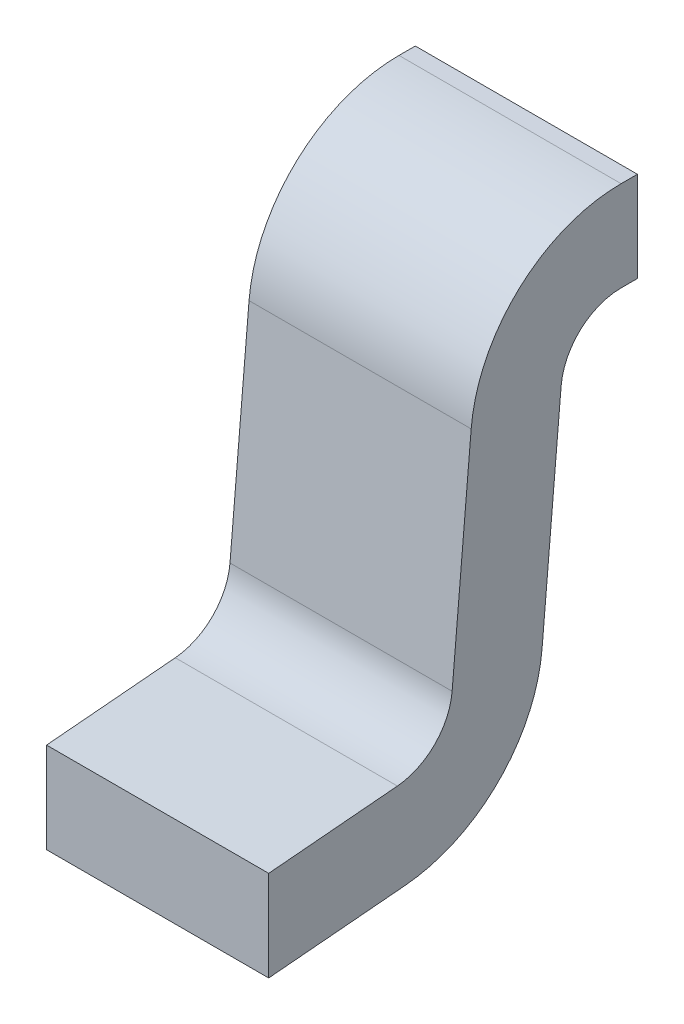
ISO-10303-21;
HEADER;
FILE_DESCRIPTION(('STEP AP214'),'2;1');
FILE_NAME('part.step','',(''),(''),'','','');
FILE_SCHEMA(('AUTOMOTIVE_DESIGN { 1 0 10303 214 1 1 1 1 }'));
ENDSEC;
DATA;
#1=APPLICATION_CONTEXT('core data for automotive mechanical design processes');
#2=APPLICATION_PROTOCOL_DEFINITION('international standard','automotive_design',2000,#1);
#3=PRODUCT_CONTEXT('',#1,'mechanical');
#4=PRODUCT('Part','Part','',(#3));
#5=PRODUCT_RELATED_PRODUCT_CATEGORY('part','',(#4));
#6=PRODUCT_DEFINITION_FORMATION('','',#4);
#7=PRODUCT_DEFINITION_CONTEXT('part definition',#1,'design');
#8=PRODUCT_DEFINITION('design','',#6,#7);
#9=PRODUCT_DEFINITION_SHAPE('','',#8);
#10=(LENGTH_UNIT() NAMED_UNIT(*) SI_UNIT(.MILLI.,.METRE.));
#11=(NAMED_UNIT(*) PLANE_ANGLE_UNIT() SI_UNIT($,.RADIAN.));
#12=(NAMED_UNIT(*) SI_UNIT($,.STERADIAN.) SOLID_ANGLE_UNIT());
#13=UNCERTAINTY_MEASURE_WITH_UNIT(LENGTH_MEASURE(1.E-05),#10,'distance_accuracy_value','');
#14=(GEOMETRIC_REPRESENTATION_CONTEXT(3) GLOBAL_UNCERTAINTY_ASSIGNED_CONTEXT((#13)) GLOBAL_UNIT_ASSIGNED_CONTEXT((#10,
#11,#12)) REPRESENTATION_CONTEXT('',''));
#15=CARTESIAN_POINT('',(0.,0.,0.));
#16=DIRECTION('',(0.,0.,1.));
#17=DIRECTION('',(1.,0.,0.));
#18=AXIS2_PLACEMENT_3D('',#15,#16,#17);
#19=CARTESIAN_POINT('',(-0.187452,0.,0.));
#20=DIRECTION('',(1.,0.,0.));
#21=DIRECTION('',(0.,1.,0.));
#22=AXIS2_PLACEMENT_3D('',#19,#20,#21);
#23=PLANE('',#22);
#24=DIRECTION('',(0.,-0.0871557427476379,0.996194698091747));
#25=VECTOR('',#24,1.);
#26=CARTESIAN_POINT('',(-0.187452,-0.03121454129347,0.23999111031));
#27=LINE('',#26,#25);
#28=CARTESIAN_POINT('',(-0.187452,-0.03121454129347,0.23999111031));
#29=VERTEX_POINT('',#28);
#30=CARTESIAN_POINT('',(-0.187452,-0.0502178567584,0.4572));
#31=VERTEX_POINT('',#30);
#32=EDGE_CURVE('E41',#29,#31,#27,.T.);
#33=ORIENTED_EDGE('',*,*,#32,.F.);
#34=CARTESIAN_POINT('',(-0.187452,0.06999884003265,0.248846133773));
#35=DIRECTION('',(1.,0.,0.));
#36=DIRECTION('',(0.,-0.996194698091747,-0.0871557427476379));
#37=AXIS2_PLACEMENT_3D('',#34,#35,#36);
#38=CIRCLE('',#37,0.1016);
#39=CARTESIAN_POINT('',(-0.187452,0.0611438165695,0.147632752447));
#40=VERTEX_POINT('',#39);
#41=EDGE_CURVE('E11',#29,#40,#38,.T.);
#42=ORIENTED_EDGE('',*,*,#41,.T.);
#43=DIRECTION('',(0.,0.996194698091747,-0.0871557427476379));
#44=VECTOR('',#43,1.);
#45=CARTESIAN_POINT('',(-0.187452,0.0611438165695,0.147632752447));
#46=LINE('',#45,#44);
#47=CARTESIAN_POINT('',(-0.187452,0.428537558658,0.115489964964));
#48=VERTEX_POINT('',#47);
#49=EDGE_CURVE('E28',#40,#48,#46,.T.);
#50=ORIENTED_EDGE('',*,*,#49,.T.);
#51=CARTESIAN_POINT('',(-0.187452,0.4064,-0.137543488351));
#52=DIRECTION('',(-1.,0.,0.));
#53=DIRECTION('',(0.,0.0871557427476379,0.996194698091747));
#54=AXIS2_PLACEMENT_3D('',#51,#52,#53);
#55=CIRCLE('',#54,0.254);
#56=CARTESIAN_POINT('',(-0.187452,0.6604,-0.137543488351));
#57=VERTEX_POINT('',#56);
#58=EDGE_CURVE('E230',#48,#57,#55,.T.);
#59=ORIENTED_EDGE('',*,*,#58,.T.);
#60=DIRECTION('',(0.,0.,1.));
#61=VECTOR('',#60,1.);
#62=CARTESIAN_POINT('',(-0.187452,0.6604,-0.1651));
#63=LINE('',#62,#61);
#64=CARTESIAN_POINT('',(-0.187452,0.6604,-0.1651));
#65=VERTEX_POINT('',#64);
#66=EDGE_CURVE('E180',#65,#57,#63,.T.);
#67=ORIENTED_EDGE('',*,*,#66,.F.);
#68=DIRECTION('',(0.,1.,0.));
#69=VECTOR('',#68,1.);
#70=CARTESIAN_POINT('',(-0.187452,0.508,-0.1651));
#71=LINE('',#70,#69);
#72=CARTESIAN_POINT('',(-0.187452,0.508,-0.1651));
#73=VERTEX_POINT('',#72);
#74=EDGE_CURVE('E181',#73,#65,#71,.T.);
#75=ORIENTED_EDGE('',*,*,#74,.F.);
#76=DIRECTION('',(0.,0.,-1.));
#77=VECTOR('',#76,1.);
#78=CARTESIAN_POINT('',(-0.187452,0.508,-0.137543488351));
#79=LINE('',#78,#77);
#80=CARTESIAN_POINT('',(-0.187452,0.508,-0.137543488351));
#81=VERTEX_POINT('',#80);
#82=EDGE_CURVE('E186',#81,#73,#79,.T.);
#83=ORIENTED_EDGE('',*,*,#82,.F.);
#84=CARTESIAN_POINT('',(-0.187452,0.4064,-0.137543488351));
#85=DIRECTION('',(1.,0.,0.));
#86=DIRECTION('',(0.,1.,0.));
#87=AXIS2_PLACEMENT_3D('',#84,#85,#86);
#88=CIRCLE('',#87,0.1016);
#89=CARTESIAN_POINT('',(-0.187452,0.415255023463,-0.03633010702521));
#90=VERTEX_POINT('',#89);
#91=EDGE_CURVE('E234',#81,#90,#88,.T.);
#92=ORIENTED_EDGE('',*,*,#91,.T.);
#93=DIRECTION('',(0.,-0.996194698091747,0.0871557427476379));
#94=VECTOR('',#93,1.);
#95=CARTESIAN_POINT('',(-0.187452,0.415255023463,-0.03633010702521));
#96=LINE('',#95,#94);
#97=CARTESIAN_POINT('',(-0.187452,0.04786128137476,-0.004187319542116));
#98=VERTEX_POINT('',#97);
#99=EDGE_CURVE('E174',#90,#98,#96,.T.);
#100=ORIENTED_EDGE('',*,*,#99,.T.);
#101=CARTESIAN_POINT('',(-0.187452,0.06999884003265,0.248846133773));
#102=DIRECTION('',(-1.,0.,0.));
#103=DIRECTION('',(0.,-0.0871557427476379,-0.996194698091747));
#104=AXIS2_PLACEMENT_3D('',#101,#102,#103);
#105=CIRCLE('',#104,0.254);
#106=CARTESIAN_POINT('',(-0.187452,-0.183034613283,0.226708575115));
#107=VERTEX_POINT('',#106);
#108=EDGE_CURVE('E137',#98,#107,#105,.T.);
#109=ORIENTED_EDGE('',*,*,#108,.T.);
#110=DIRECTION('',(0.,0.0871557427476379,-0.996194698091747));
#111=VECTOR('',#110,1.);
#112=CARTESIAN_POINT('',(-0.187452,-0.2032,0.4572));
#113=LINE('',#112,#111);
#114=CARTESIAN_POINT('',(-0.187452,-0.2032,0.4572));
#115=VERTEX_POINT('',#114);
#116=EDGE_CURVE('E141',#115,#107,#113,.T.);
#117=ORIENTED_EDGE('',*,*,#116,.F.);
#118=DIRECTION('',(0.,1.,0.));
#119=VECTOR('',#118,1.);
#120=CARTESIAN_POINT('',(-0.187452,-0.2032,0.4572));
#121=LINE('',#120,#119);
#122=EDGE_CURVE('E175',#115,#31,#121,.T.);
#123=ORIENTED_EDGE('',*,*,#122,.T.);
#124=EDGE_LOOP('',(#33,#42,#50,#59,#67,#75,#83,#92,#100,#109,#117,#123));
#125=FACE_BOUND('',#124,.T.);
#126=ADVANCED_FACE('F17',(#125),#23,.F.);
#127=CARTESIAN_POINT('',(0.2249424,-0.2032,0.4572));
#128=DIRECTION('',(0.,0.,-1.));
#129=DIRECTION('',(0.,-1.,0.));
#130=AXIS2_PLACEMENT_3D('',#127,#128,#129);
#131=PLANE('',#130);
#132=DIRECTION('',(1.,0.,0.));
#133=VECTOR('',#132,1.);
#134=CARTESIAN_POINT('',(-0.187452,-0.2032,0.4572));
#135=LINE('',#134,#133);
#136=CARTESIAN_POINT('',(0.187452,-0.2032,0.4572));
#137=VERTEX_POINT('',#136);
#138=EDGE_CURVE('E196',#115,#137,#135,.T.);
#139=ORIENTED_EDGE('',*,*,#138,.T.);
#140=DIRECTION('',(0.,1.,0.));
#141=VECTOR('',#140,1.);
#142=CARTESIAN_POINT('',(0.187452,-0.2032,0.4572));
#143=LINE('',#142,#141);
#144=CARTESIAN_POINT('',(0.187452,-0.0502178567584,0.4572));
#145=VERTEX_POINT('',#144);
#146=EDGE_CURVE('E216',#137,#145,#143,.T.);
#147=ORIENTED_EDGE('',*,*,#146,.T.);
#148=DIRECTION('',(1.,0.,0.));
#149=VECTOR('',#148,1.);
#150=CARTESIAN_POINT('',(-0.187452,-0.0502178567584,0.4572));
#151=LINE('',#150,#149);
#152=EDGE_CURVE('E170',#31,#145,#151,.T.);
#153=ORIENTED_EDGE('',*,*,#152,.F.);
#154=ORIENTED_EDGE('',*,*,#122,.F.);
#155=EDGE_LOOP('',(#139,#147,#153,#154));
#156=FACE_BOUND('',#155,.T.);
#157=ADVANCED_FACE('F274',(#156),#131,.F.);
#158=CARTESIAN_POINT('',(-0.187452,-0.02378429437146,0.155062999369));
#159=DIRECTION('',(0.,0.996194698091747,0.0871557427476379));
#160=DIRECTION('',(1.,0.,0.));
#161=AXIS2_PLACEMENT_3D('',#158,#159,#160);
#162=PLANE('',#161);
#163=DIRECTION('',(0.,-0.0871557427476379,0.996194698091747));
#164=VECTOR('',#163,1.);
#165=CARTESIAN_POINT('',(0.187452,-0.03121454129347,0.23999111031));
#166=LINE('',#165,#164);
#167=CARTESIAN_POINT('',(0.187452,-0.03121454129347,0.23999111031));
#168=VERTEX_POINT('',#167);
#169=EDGE_CURVE('E157',#168,#145,#166,.T.);
#170=ORIENTED_EDGE('',*,*,#169,.F.);
#171=DIRECTION('',(1.,0.,0.));
#172=VECTOR('',#171,1.);
#173=CARTESIAN_POINT('',(-0.187452,-0.03121454129347,0.23999111031));
#174=LINE('',#173,#172);
#175=EDGE_CURVE('E171',#29,#168,#174,.T.);
#176=ORIENTED_EDGE('',*,*,#175,.F.);
#177=ORIENTED_EDGE('',*,*,#32,.T.);
#178=ORIENTED_EDGE('',*,*,#152,.T.);
#179=EDGE_LOOP('',(#170,#176,#177,#178));
#180=FACE_BOUND('',#179,.T.);
#181=ADVANCED_FACE('F268',(#180),#162,.T.);
#182=CARTESIAN_POINT('',(-0.187452,0.06999884003265,0.248846133773));
#183=DIRECTION('',(1.,0.,0.));
#184=DIRECTION('',(0.,-0.996194698091747,-0.0871557427476379));
#185=AXIS2_PLACEMENT_3D('',#182,#183,#184);
#186=CYLINDRICAL_SURFACE('',#185,0.1016);
#187=CARTESIAN_POINT('',(0.187452,0.06999884003265,0.248846133773));
#188=DIRECTION('',(1.,0.,0.));
#189=DIRECTION('',(0.,-0.996194698091747,-0.0871557427476379));
#190=AXIS2_PLACEMENT_3D('',#187,#188,#189);
#191=CIRCLE('',#190,0.1016);
#192=CARTESIAN_POINT('',(0.187452,0.0611438165695,0.147632752447));
#193=VERTEX_POINT('',#192);
#194=EDGE_CURVE('E167',#168,#193,#191,.T.);
#195=ORIENTED_EDGE('',*,*,#194,.T.);
#196=DIRECTION('',(1.,0.,0.));
#197=VECTOR('',#196,1.);
#198=CARTESIAN_POINT('',(-0.187452,0.0611438165695,0.147632752447));
#199=LINE('',#198,#197);
#200=EDGE_CURVE('E187',#40,#193,#199,.T.);
#201=ORIENTED_EDGE('',*,*,#200,.F.);
#202=ORIENTED_EDGE('',*,*,#41,.F.);
#203=ORIENTED_EDGE('',*,*,#175,.T.);
#204=EDGE_LOOP('',(#195,#201,#202,#203));
#205=FACE_BOUND('',#204,.T.);
#206=ADVANCED_FACE('F273',(#205),#186,.F.);
#207=CARTESIAN_POINT('',(-0.187452,0.01328253519474,0.151820071989));
#208=DIRECTION('',(0.,0.0871557427476379,0.996194698091747));
#209=DIRECTION('',(1.,0.,0.));
#210=AXIS2_PLACEMENT_3D('',#207,#208,#209);
#211=PLANE('',#210);
#212=ORIENTED_EDGE('',*,*,#200,.T.);
#213=DIRECTION('',(0.,-0.996194698091747,0.0871557427476379));
#214=VECTOR('',#213,1.);
#215=CARTESIAN_POINT('',(0.187452,0.428537558658,0.115489964964));
#216=LINE('',#215,#214);
#217=CARTESIAN_POINT('',(0.187452,0.428537558658,0.115489964964));
#218=VERTEX_POINT('',#217);
#219=EDGE_CURVE('E163',#218,#193,#216,.T.);
#220=ORIENTED_EDGE('',*,*,#219,.F.);
#221=DIRECTION('',(1.,0.,0.));
#222=VECTOR('',#221,1.);
#223=CARTESIAN_POINT('',(-0.187452,0.428537558658,0.115489964964));
#224=LINE('',#223,#222);
#225=EDGE_CURVE('E217',#48,#218,#224,.T.);
#226=ORIENTED_EDGE('',*,*,#225,.F.);
#227=ORIENTED_EDGE('',*,*,#49,.F.);
#228=EDGE_LOOP('',(#212,#220,#226,#227));
#229=FACE_BOUND('',#228,.T.);
#230=ADVANCED_FACE('F285',(#229),#211,.T.);
#231=CARTESIAN_POINT('',(-0.187452,0.4064,-0.137543488351));
#232=DIRECTION('',(-1.,0.,0.));
#233=DIRECTION('',(0.,0.0871557427476379,0.996194698091747));
#234=AXIS2_PLACEMENT_3D('',#231,#232,#233);
#235=CYLINDRICAL_SURFACE('',#234,0.254);
#236=CARTESIAN_POINT('',(0.187452,0.4064,-0.137543488351));
#237=DIRECTION('',(-1.,0.,0.));
#238=DIRECTION('',(0.,0.0871557427476379,0.996194698091747));
#239=AXIS2_PLACEMENT_3D('',#236,#237,#238);
#240=CIRCLE('',#239,0.254);
#241=CARTESIAN_POINT('',(0.187452,0.6604,-0.137543488351));
#242=VERTEX_POINT('',#241);
#243=EDGE_CURVE('E190',#218,#242,#240,.T.);
#244=ORIENTED_EDGE('',*,*,#243,.T.);
#245=DIRECTION('',(1.,0.,0.));
#246=VECTOR('',#245,1.);
#247=CARTESIAN_POINT('',(-0.187452,0.6604,-0.137543488351));
#248=LINE('',#247,#246);
#249=EDGE_CURVE('E221',#57,#242,#248,.T.);
#250=ORIENTED_EDGE('',*,*,#249,.F.);
#251=ORIENTED_EDGE('',*,*,#58,.F.);
#252=ORIENTED_EDGE('',*,*,#225,.T.);
#253=EDGE_LOOP('',(#244,#250,#251,#252));
#254=FACE_BOUND('',#253,.T.);
#255=ADVANCED_FACE('F19',(#254),#235,.T.);
#256=CARTESIAN_POINT('',(-0.187452,0.6604,-0.1651));
#257=DIRECTION('',(0.,1.,0.));
#258=DIRECTION('',(1.,0.,0.));
#259=AXIS2_PLACEMENT_3D('',#256,#257,#258);
#260=PLANE('',#259);
#261=ORIENTED_EDGE('',*,*,#249,.T.);
#262=DIRECTION('',(0.,0.,1.));
#263=VECTOR('',#262,1.);
#264=CARTESIAN_POINT('',(0.187452,0.6604,-0.1651));
#265=LINE('',#264,#263);
#266=CARTESIAN_POINT('',(0.187452,0.6604,-0.1651));
#267=VERTEX_POINT('',#266);
#268=EDGE_CURVE('E204',#267,#242,#265,.T.);
#269=ORIENTED_EDGE('',*,*,#268,.F.);
#270=DIRECTION('',(1.,0.,0.));
#271=VECTOR('',#270,1.);
#272=CARTESIAN_POINT('',(-0.187452,0.6604,-0.1651));
#273=LINE('',#272,#271);
#274=EDGE_CURVE('E176',#65,#267,#273,.T.);
#275=ORIENTED_EDGE('',*,*,#274,.F.);
#276=ORIENTED_EDGE('',*,*,#66,.T.);
#277=EDGE_LOOP('',(#261,#269,#275,#276));
#278=FACE_BOUND('',#277,.T.);
#279=ADVANCED_FACE('F313',(#278),#260,.T.);
#280=CARTESIAN_POINT('',(-0.187452,0.508,-0.1651));
#281=DIRECTION('',(0.,0.,-1.));
#282=DIRECTION('',(0.,-1.,0.));
#283=AXIS2_PLACEMENT_3D('',#280,#281,#282);
#284=PLANE('',#283);
#285=ORIENTED_EDGE('',*,*,#274,.T.);
#286=DIRECTION('',(0.,1.,0.));
#287=VECTOR('',#286,1.);
#288=CARTESIAN_POINT('',(0.187452,0.508,-0.1651));
#289=LINE('',#288,#287);
#290=CARTESIAN_POINT('',(0.187452,0.508,-0.1651));
#291=VERTEX_POINT('',#290);
#292=EDGE_CURVE('E194',#291,#267,#289,.T.);
#293=ORIENTED_EDGE('',*,*,#292,.F.);
#294=DIRECTION('',(1.,0.,0.));
#295=VECTOR('',#294,1.);
#296=CARTESIAN_POINT('',(-0.187452,0.508,-0.1651));
#297=LINE('',#296,#295);
#298=EDGE_CURVE('E182',#73,#291,#297,.T.);
#299=ORIENTED_EDGE('',*,*,#298,.F.);
#300=ORIENTED_EDGE('',*,*,#74,.T.);
#301=EDGE_LOOP('',(#285,#293,#299,#300));
#302=FACE_BOUND('',#301,.T.);
#303=ADVANCED_FACE('F318',(#302),#284,.T.);
#304=CARTESIAN_POINT('',(-0.187452,0.508,-0.04444424107116));
#305=DIRECTION('',(0.,-1.,0.));
#306=DIRECTION('',(0.,0.,-1.));
#307=AXIS2_PLACEMENT_3D('',#304,#305,#306);
#308=PLANE('',#307);
#309=ORIENTED_EDGE('',*,*,#298,.T.);
#310=DIRECTION('',(0.,0.,-1.));
#311=VECTOR('',#310,1.);
#312=CARTESIAN_POINT('',(0.187452,0.508,-0.137543488351));
#313=LINE('',#312,#311);
#314=CARTESIAN_POINT('',(0.187452,0.508,-0.137543488351));
#315=VERTEX_POINT('',#314);
#316=EDGE_CURVE('E152',#315,#291,#313,.T.);
#317=ORIENTED_EDGE('',*,*,#316,.F.);
#318=DIRECTION('',(1.,0.,0.));
#319=VECTOR('',#318,1.);
#320=CARTESIAN_POINT('',(-0.187452,0.508,-0.137543488351));
#321=LINE('',#320,#319);
#322=EDGE_CURVE('E205',#81,#315,#321,.T.);
#323=ORIENTED_EDGE('',*,*,#322,.F.);
#324=ORIENTED_EDGE('',*,*,#82,.T.);
#325=EDGE_LOOP('',(#309,#317,#323,#324));
#326=FACE_BOUND('',#325,.T.);
#327=ADVANCED_FACE('F297',(#326),#308,.T.);
#328=CARTESIAN_POINT('',(-0.187452,0.4064,-0.137543488351));
#329=DIRECTION('',(1.,0.,0.));
#330=DIRECTION('',(0.,1.,0.));
#331=AXIS2_PLACEMENT_3D('',#328,#329,#330);
#332=CYLINDRICAL_SURFACE('',#331,0.1016);
#333=CARTESIAN_POINT('',(0.187452,0.4064,-0.137543488351));
#334=DIRECTION('',(1.,0.,0.));
#335=DIRECTION('',(0.,1.,0.));
#336=AXIS2_PLACEMENT_3D('',#333,#334,#335);
#337=CIRCLE('',#336,0.1016);
#338=CARTESIAN_POINT('',(0.187452,0.415255023463,-0.03633010702521));
#339=VERTEX_POINT('',#338);
#340=EDGE_CURVE('E208',#315,#339,#337,.T.);
#341=ORIENTED_EDGE('',*,*,#340,.T.);
#342=DIRECTION('',(1.,0.,0.));
#343=VECTOR('',#342,1.);
#344=CARTESIAN_POINT('',(-0.187452,0.415255023463,-0.03633010702521));
#345=LINE('',#344,#343);
#346=EDGE_CURVE('E146',#90,#339,#345,.T.);
#347=ORIENTED_EDGE('',*,*,#346,.F.);
#348=ORIENTED_EDGE('',*,*,#91,.F.);
#349=ORIENTED_EDGE('',*,*,#322,.T.);
#350=EDGE_LOOP('',(#341,#347,#348,#349));
#351=FACE_BOUND('',#350,.T.);
#352=ADVANCED_FACE('F292',(#351),#332,.F.);
#353=CARTESIAN_POINT('',(-0.187452,-0.164458995978,0.0143882977629));
#354=DIRECTION('',(0.,-0.0871557427476379,-0.996194698091747));
#355=DIRECTION('',(0.,-0.996194698091747,0.0871557427476379));
#356=AXIS2_PLACEMENT_3D('',#353,#354,#355);
#357=PLANE('',#356);
#358=DIRECTION('',(1.,0.,0.));
#359=VECTOR('',#358,1.);
#360=CARTESIAN_POINT('',(-0.187452,0.04786128137476,-0.004187319542116));
#361=LINE('',#360,#359);
#362=CARTESIAN_POINT('',(0.187452,0.04786128137476,-0.004187319542116));
#363=VERTEX_POINT('',#362);
#364=EDGE_CURVE('E129',#98,#363,#361,.T.);
#365=ORIENTED_EDGE('',*,*,#364,.F.);
#366=ORIENTED_EDGE('',*,*,#99,.F.);
#367=ORIENTED_EDGE('',*,*,#346,.T.);
#368=DIRECTION('',(0.,0.996194698091747,-0.0871557427476379));
#369=VECTOR('',#368,1.);
#370=CARTESIAN_POINT('',(0.187452,0.04786128137476,-0.004187319542116));
#371=LINE('',#370,#369);
#372=EDGE_CURVE('E21',#363,#339,#371,.T.);
#373=ORIENTED_EDGE('',*,*,#372,.F.);
#374=EDGE_LOOP('',(#365,#366,#367,#373));
#375=FACE_BOUND('',#374,.T.);
#376=ADVANCED_FACE('F144',(#375),#357,.T.);
#377=CARTESIAN_POINT('',(0.187452,0.,0.));
#378=DIRECTION('',(1.,0.,0.));
#379=DIRECTION('',(0.,1.,0.));
#380=AXIS2_PLACEMENT_3D('',#377,#378,#379);
#381=PLANE('',#380);
#382=DIRECTION('',(0.,0.0871557427476379,-0.996194698091747));
#383=VECTOR('',#382,1.);
#384=CARTESIAN_POINT('',(0.187452,-0.2032,0.4572));
#385=LINE('',#384,#383);
#386=CARTESIAN_POINT('',(0.187452,-0.183034613283,0.226708575115));
#387=VERTEX_POINT('',#386);
#388=EDGE_CURVE('E151',#137,#387,#385,.T.);
#389=ORIENTED_EDGE('',*,*,#388,.T.);
#390=CARTESIAN_POINT('',(0.187452,0.06999884003265,0.248846133773));
#391=DIRECTION('',(-1.,0.,0.));
#392=DIRECTION('',(0.,-0.0871557427476379,-0.996194698091747));
#393=AXIS2_PLACEMENT_3D('',#390,#391,#392);
#394=CIRCLE('',#393,0.254);
#395=EDGE_CURVE('E134',#363,#387,#394,.T.);
#396=ORIENTED_EDGE('',*,*,#395,.F.);
#397=ORIENTED_EDGE('',*,*,#372,.T.);
#398=ORIENTED_EDGE('',*,*,#340,.F.);
#399=ORIENTED_EDGE('',*,*,#316,.T.);
#400=ORIENTED_EDGE('',*,*,#292,.T.);
#401=ORIENTED_EDGE('',*,*,#268,.T.);
#402=ORIENTED_EDGE('',*,*,#243,.F.);
#403=ORIENTED_EDGE('',*,*,#219,.T.);
#404=ORIENTED_EDGE('',*,*,#194,.F.);
#405=ORIENTED_EDGE('',*,*,#169,.T.);
#406=ORIENTED_EDGE('',*,*,#146,.F.);
#407=EDGE_LOOP('',(#389,#396,#397,#398,#399,#400,#401,#402,#403,#404,#405,#406));
#408=FACE_BOUND('',#407,.T.);
#409=ADVANCED_FACE('F153',(#408),#381,.T.);
#410=CARTESIAN_POINT('',(-0.187452,0.06999884003265,0.248846133773));
#411=DIRECTION('',(-1.,0.,0.));
#412=DIRECTION('',(0.,-0.0871557427476379,-0.996194698091747));
#413=AXIS2_PLACEMENT_3D('',#410,#411,#412);
#414=CYLINDRICAL_SURFACE('',#413,0.254);
#415=ORIENTED_EDGE('',*,*,#395,.T.);
#416=DIRECTION('',(1.,0.,0.));
#417=VECTOR('',#416,1.);
#418=CARTESIAN_POINT('',(-0.187452,-0.183034613283,0.226708575115));
#419=LINE('',#418,#417);
#420=EDGE_CURVE('E198',#107,#387,#419,.T.);
#421=ORIENTED_EDGE('',*,*,#420,.F.);
#422=ORIENTED_EDGE('',*,*,#108,.F.);
#423=ORIENTED_EDGE('',*,*,#364,.T.);
#424=EDGE_LOOP('',(#415,#421,#422,#423));
#425=FACE_BOUND('',#424,.T.);
#426=ADVANCED_FACE('F131',(#425),#414,.T.);
#427=CARTESIAN_POINT('',(-0.187452,-0.2032,0.4572));
#428=DIRECTION('',(0.,-0.996194698091747,-0.0871557427476379));
#429=DIRECTION('',(0.,0.0871557427476379,-0.996194698091747));
#430=AXIS2_PLACEMENT_3D('',#427,#428,#429);
#431=PLANE('',#430);
#432=ORIENTED_EDGE('',*,*,#116,.T.);
#433=ORIENTED_EDGE('',*,*,#420,.T.);
#434=ORIENTED_EDGE('',*,*,#388,.F.);
#435=ORIENTED_EDGE('',*,*,#138,.F.);
#436=EDGE_LOOP('',(#432,#433,#434,#435));
#437=FACE_BOUND('',#436,.T.);
#438=ADVANCED_FACE('F307',(#437),#431,.T.);
#439=CLOSED_SHELL('',(#126,#157,#181,#206,#230,#255,#279,#303,#327,#352,#376,#409,#426,#438));
#440=MANIFOLD_SOLID_BREP('B1',#439);
#441=ADVANCED_BREP_SHAPE_REPRESENTATION('',(#18,#440),#14);
#442=SHAPE_DEFINITION_REPRESENTATION(#9,#441);
ENDSEC;
END-ISO-10303-21;
